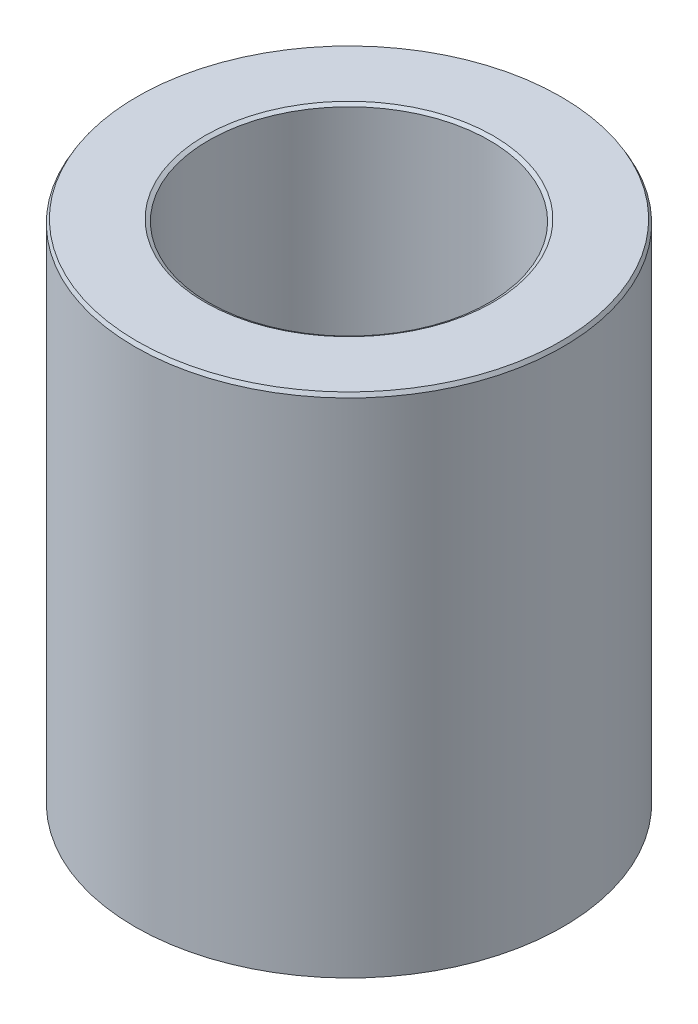
ISO-10303-21;
HEADER;
FILE_DESCRIPTION(('STEP AP214'),'2;1');
FILE_NAME('part.step','',(''),(''),'','','');
FILE_SCHEMA(('AUTOMOTIVE_DESIGN { 1 0 10303 214 1 1 1 1 }'));
ENDSEC;
DATA;
#1=APPLICATION_CONTEXT('core data for automotive mechanical design processes');
#2=APPLICATION_PROTOCOL_DEFINITION('international standard','automotive_design',2000,#1);
#3=PRODUCT_CONTEXT('',#1,'mechanical');
#4=PRODUCT('Part','Part','',(#3));
#5=PRODUCT_RELATED_PRODUCT_CATEGORY('part','',(#4));
#6=PRODUCT_DEFINITION_FORMATION('','',#4);
#7=PRODUCT_DEFINITION_CONTEXT('part definition',#1,'design');
#8=PRODUCT_DEFINITION('design','',#6,#7);
#9=PRODUCT_DEFINITION_SHAPE('','',#8);
#10=(LENGTH_UNIT() NAMED_UNIT(*) SI_UNIT(.MILLI.,.METRE.));
#11=(NAMED_UNIT(*) PLANE_ANGLE_UNIT() SI_UNIT($,.RADIAN.));
#12=(NAMED_UNIT(*) SI_UNIT($,.STERADIAN.) SOLID_ANGLE_UNIT());
#13=UNCERTAINTY_MEASURE_WITH_UNIT(LENGTH_MEASURE(1.E-05),#10,'distance_accuracy_value','');
#14=(GEOMETRIC_REPRESENTATION_CONTEXT(3) GLOBAL_UNCERTAINTY_ASSIGNED_CONTEXT((#13)) GLOBAL_UNIT_ASSIGNED_CONTEXT((#10,
#11,#12)) REPRESENTATION_CONTEXT('',''));
#15=CARTESIAN_POINT('',(0.,0.,0.));
#16=DIRECTION('',(0.,0.,1.));
#17=DIRECTION('',(1.,0.,0.));
#18=AXIS2_PLACEMENT_3D('',#15,#16,#17);
#19=CARTESIAN_POINT('',(0.,130.584568868856,0.));
#20=DIRECTION('',(0.,-1.,0.));
#21=DIRECTION('',(0.,0.,-1.));
#22=AXIS2_PLACEMENT_3D('',#19,#20,#21);
#23=CYLINDRICAL_SURFACE('',#22,55.);
#24=CARTESIAN_POINT('',(0.,0.553626940664687,0.));
#25=DIRECTION('',(0.,1.,0.));
#26=DIRECTION('',(0.,0.,1.));
#27=AXIS2_PLACEMENT_3D('',#24,#25,#26);
#28=CIRCLE('',#27,55.);
#29=CARTESIAN_POINT('',(0.,0.553626940664687,55.));
#30=VERTEX_POINT('',#29);
#31=EDGE_CURVE('E10',#30,#30,#28,.T.);
#32=ORIENTED_EDGE('',*,*,#31,.T.);
#33=EDGE_LOOP('',(#32));
#34=FACE_BOUND('',#33,.T.);
#35=CARTESIAN_POINT('',(0.,129.625658879186,0.));
#36=DIRECTION('',(0.,1.,0.));
#37=DIRECTION('',(0.,0.,1.));
#38=AXIS2_PLACEMENT_3D('',#35,#36,#37);
#39=CIRCLE('',#38,55.);
#40=CARTESIAN_POINT('',(0.,129.625658879186,55.));
#41=VERTEX_POINT('',#40);
#42=EDGE_CURVE('E50',#41,#41,#39,.F.);
#43=ORIENTED_EDGE('',*,*,#42,.T.);
#44=EDGE_LOOP('',(#43));
#45=FACE_BOUND('',#44,.T.);
#46=ADVANCED_FACE('F39',(#34,#45),#23,.T.);
#47=CARTESIAN_POINT('',(0.,130.584568868856,0.));
#48=DIRECTION('',(0.,1.,0.));
#49=DIRECTION('',(0.,0.,1.));
#50=AXIS2_PLACEMENT_3D('',#47,#48,#49);
#51=PLANE('',#50);
#52=CARTESIAN_POINT('',(0.,130.584568868856,0.));
#53=DIRECTION('',(0.,1.,0.));
#54=DIRECTION('',(0.,0.,1.));
#55=AXIS2_PLACEMENT_3D('',#52,#53,#54);
#56=CIRCLE('',#55,37.0546245119383);
#57=CARTESIAN_POINT('',(0.,130.584568868856,37.0546245119383));
#58=VERTEX_POINT('',#57);
#59=EDGE_CURVE('E58',#58,#58,#56,.F.);
#60=ORIENTED_EDGE('',*,*,#59,.T.);
#61=EDGE_LOOP('',(#60));
#62=FACE_BOUND('',#61,.T.);
#63=CARTESIAN_POINT('',(0.,130.584568868856,0.));
#64=DIRECTION('',(0.,1.,0.));
#65=DIRECTION('',(0.,0.,1.));
#66=AXIS2_PLACEMENT_3D('',#63,#64,#65);
#67=CIRCLE('',#66,54.4463730593353);
#68=CARTESIAN_POINT('',(0.,130.584568868856,54.4463730593353));
#69=VERTEX_POINT('',#68);
#70=EDGE_CURVE('E61',#69,#69,#67,.T.);
#71=ORIENTED_EDGE('',*,*,#70,.T.);
#72=EDGE_LOOP('',(#71));
#73=FACE_BOUND('',#72,.T.);
#74=ADVANCED_FACE('F88',(#62,#73),#51,.T.);
#75=CARTESIAN_POINT('',(0.,0.,0.));
#76=DIRECTION('',(0.,1.,0.));
#77=DIRECTION('',(0.,0.,1.));
#78=AXIS2_PLACEMENT_3D('',#75,#76,#77);
#79=PLANE('',#78);
#80=CARTESIAN_POINT('',(0.,0.,0.));
#81=DIRECTION('',(0.,1.,0.));
#82=DIRECTION('',(0.,0.,1.));
#83=AXIS2_PLACEMENT_3D('',#80,#81,#82);
#84=CIRCLE('',#83,36.6493414629328);
#85=CARTESIAN_POINT('',(0.,0.,36.6493414629328));
#86=VERTEX_POINT('',#85);
#87=EDGE_CURVE('E51',#86,#86,#84,.T.);
#88=ORIENTED_EDGE('',*,*,#87,.T.);
#89=EDGE_LOOP('',(#88));
#90=FACE_BOUND('',#89,.T.);
#91=CARTESIAN_POINT('',(0.,0.,0.));
#92=DIRECTION('',(0.,1.,0.));
#93=DIRECTION('',(0.,0.,1.));
#94=AXIS2_PLACEMENT_3D('',#91,#92,#93);
#95=CIRCLE('',#94,54.0410900103299);
#96=CARTESIAN_POINT('',(0.,0.,54.0410900103299));
#97=VERTEX_POINT('',#96);
#98=EDGE_CURVE('E54',#97,#97,#95,.F.);
#99=ORIENTED_EDGE('',*,*,#98,.T.);
#100=EDGE_LOOP('',(#99));
#101=FACE_BOUND('',#100,.T.);
#102=ADVANCED_FACE('F83',(#90,#101),#79,.F.);
#103=CARTESIAN_POINT('',(0.,130.584568868856,0.));
#104=DIRECTION('',(0.,-1.,0.));
#105=DIRECTION('',(0.,0.,-1.));
#106=AXIS2_PLACEMENT_3D('',#103,#104,#105);
#107=CYLINDRICAL_SURFACE('',#106,36.0957145222681);
#108=CARTESIAN_POINT('',(0.,130.030941928191,0.));
#109=DIRECTION('',(0.,1.,0.));
#110=DIRECTION('',(0.,0.,1.));
#111=AXIS2_PLACEMENT_3D('',#108,#109,#110);
#112=CIRCLE('',#111,36.0957145222681);
#113=CARTESIAN_POINT('',(0.,130.030941928191,36.0957145222681));
#114=VERTEX_POINT('',#113);
#115=EDGE_CURVE('E67',#114,#114,#112,.T.);
#116=ORIENTED_EDGE('',*,*,#115,.T.);
#117=EDGE_LOOP('',(#116));
#118=FACE_BOUND('',#117,.T.);
#119=CARTESIAN_POINT('',(0.,0.958909989670215,0.));
#120=DIRECTION('',(0.,1.,0.));
#121=DIRECTION('',(0.,0.,1.));
#122=AXIS2_PLACEMENT_3D('',#119,#120,#121);
#123=CIRCLE('',#122,36.0957145222681);
#124=CARTESIAN_POINT('',(0.,0.958909989670215,36.0957145222681));
#125=VERTEX_POINT('',#124);
#126=EDGE_CURVE('E69',#125,#125,#123,.F.);
#127=ORIENTED_EDGE('',*,*,#126,.T.);
#128=EDGE_LOOP('',(#127));
#129=FACE_BOUND('',#128,.T.);
#130=ADVANCED_FACE('F71',(#118,#129),#107,.F.);
#131=CARTESIAN_POINT('',(0.,130.030941928191,0.));
#132=DIRECTION('',(0.,1.,0.));
#133=DIRECTION('',(0.,0.,1.));
#134=AXIS2_PLACEMENT_3D('',#131,#132,#133);
#135=CONICAL_SURFACE('',#134,36.0957145222681,1.04719755119658);
#136=ORIENTED_EDGE('',*,*,#59,.F.);
#137=EDGE_LOOP('',(#136));
#138=FACE_BOUND('',#137,.T.);
#139=ORIENTED_EDGE('',*,*,#115,.F.);
#140=EDGE_LOOP('',(#139));
#141=FACE_BOUND('',#140,.T.);
#142=ADVANCED_FACE('F77',(#138,#141),#135,.F.);
#143=CARTESIAN_POINT('',(0.,0.,0.));
#144=DIRECTION('',(0.,-1.,0.));
#145=DIRECTION('',(0.,0.,-1.));
#146=AXIS2_PLACEMENT_3D('',#143,#144,#145);
#147=CONICAL_SURFACE('',#146,36.6493414629328,0.5235987755983);
#148=ORIENTED_EDGE('',*,*,#126,.F.);
#149=EDGE_LOOP('',(#148));
#150=FACE_BOUND('',#149,.T.);
#151=ORIENTED_EDGE('',*,*,#87,.F.);
#152=EDGE_LOOP('',(#151));
#153=FACE_BOUND('',#152,.T.);
#154=ADVANCED_FACE('F73',(#150,#153),#147,.F.);
#155=CARTESIAN_POINT('',(0.,0.553626940664687,0.));
#156=DIRECTION('',(0.,1.,0.));
#157=DIRECTION('',(0.,0.,1.));
#158=AXIS2_PLACEMENT_3D('',#155,#156,#157);
#159=CONICAL_SURFACE('',#158,55.,1.04719755119659);
#160=ORIENTED_EDGE('',*,*,#98,.F.);
#161=EDGE_LOOP('',(#160));
#162=FACE_BOUND('',#161,.T.);
#163=ORIENTED_EDGE('',*,*,#31,.F.);
#164=EDGE_LOOP('',(#163));
#165=FACE_BOUND('',#164,.T.);
#166=ADVANCED_FACE('F76',(#162,#165),#159,.T.);
#167=CARTESIAN_POINT('',(0.,130.584568868856,0.));
#168=DIRECTION('',(0.,-1.,0.));
#169=DIRECTION('',(0.,0.,-1.));
#170=AXIS2_PLACEMENT_3D('',#167,#168,#169);
#171=CONICAL_SURFACE('',#170,54.4463730593353,0.523598775598311);
#172=ORIENTED_EDGE('',*,*,#42,.F.);
#173=EDGE_LOOP('',(#172));
#174=FACE_BOUND('',#173,.T.);
#175=ORIENTED_EDGE('',*,*,#70,.F.);
#176=EDGE_LOOP('',(#175));
#177=FACE_BOUND('',#176,.T.);
#178=ADVANCED_FACE('F45',(#174,#177),#171,.T.);
#179=CLOSED_SHELL('',(#46,#74,#102,#130,#142,#154,#166,#178));
#180=MANIFOLD_SOLID_BREP('B2',#179);
#181=ADVANCED_BREP_SHAPE_REPRESENTATION('',(#18,#180),#14);
#182=SHAPE_DEFINITION_REPRESENTATION(#9,#181);
ENDSEC;
END-ISO-10303-21;
